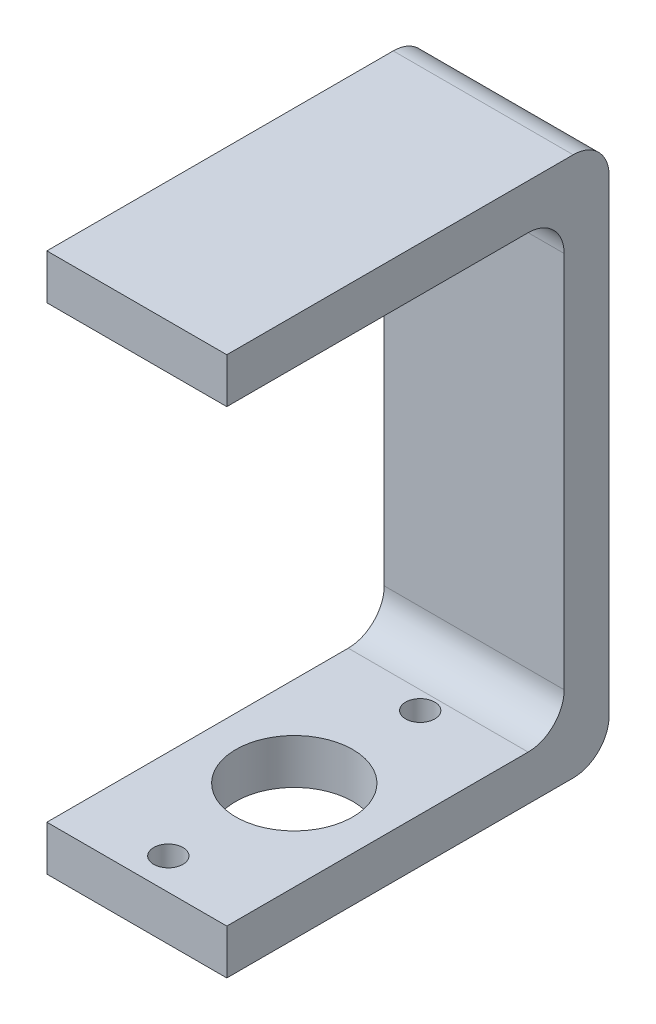
ISO-10303-21;
HEADER;
FILE_DESCRIPTION(('STEP AP214'),'2;1');
FILE_NAME('part.step','',(''),(''),'','','');
FILE_SCHEMA(('AUTOMOTIVE_DESIGN { 1 0 10303 214 1 1 1 1 }'));
ENDSEC;
DATA;
#1=APPLICATION_CONTEXT('core data for automotive mechanical design processes');
#2=APPLICATION_PROTOCOL_DEFINITION('international standard','automotive_design',2000,#1);
#3=PRODUCT_CONTEXT('',#1,'mechanical');
#4=PRODUCT('Part','Part','',(#3));
#5=PRODUCT_RELATED_PRODUCT_CATEGORY('part','',(#4));
#6=PRODUCT_DEFINITION_FORMATION('','',#4);
#7=PRODUCT_DEFINITION_CONTEXT('part definition',#1,'design');
#8=PRODUCT_DEFINITION('design','',#6,#7);
#9=PRODUCT_DEFINITION_SHAPE('','',#8);
#10=(LENGTH_UNIT() NAMED_UNIT(*) SI_UNIT(.MILLI.,.METRE.));
#11=(NAMED_UNIT(*) PLANE_ANGLE_UNIT() SI_UNIT($,.RADIAN.));
#12=(NAMED_UNIT(*) SI_UNIT($,.STERADIAN.) SOLID_ANGLE_UNIT());
#13=UNCERTAINTY_MEASURE_WITH_UNIT(LENGTH_MEASURE(1.E-05),#10,'distance_accuracy_value','');
#14=(GEOMETRIC_REPRESENTATION_CONTEXT(3) GLOBAL_UNCERTAINTY_ASSIGNED_CONTEXT((#13)) GLOBAL_UNIT_ASSIGNED_CONTEXT((#10,
#11,#12)) REPRESENTATION_CONTEXT('',''));
#15=CARTESIAN_POINT('',(0.,0.,0.));
#16=DIRECTION('',(0.,0.,1.));
#17=DIRECTION('',(1.,0.,0.));
#18=AXIS2_PLACEMENT_3D('',#15,#16,#17);
#19=CARTESIAN_POINT('',(40.,10.,0.));
#20=DIRECTION('',(0.,0.,-1.));
#21=DIRECTION('',(0.,1.,0.));
#22=AXIS2_PLACEMENT_3D('',#19,#20,#21);
#23=PLANE('',#22);
#24=DIRECTION('',(0.,-1.,0.));
#25=VECTOR('',#24,1.);
#26=CARTESIAN_POINT('',(0.,10.,0.));
#27=LINE('',#26,#25);
#28=CARTESIAN_POINT('',(0.,10.,0.));
#29=VERTEX_POINT('',#28);
#30=CARTESIAN_POINT('',(0.,0.,0.));
#31=VERTEX_POINT('',#30);
#32=EDGE_CURVE('E157',#29,#31,#27,.T.);
#33=ORIENTED_EDGE('',*,*,#32,.T.);
#34=DIRECTION('',(-1.,0.,0.));
#35=VECTOR('',#34,1.);
#36=CARTESIAN_POINT('',(40.,0.,0.));
#37=LINE('',#36,#35);
#38=CARTESIAN_POINT('',(40.,0.,0.));
#39=VERTEX_POINT('',#38);
#40=EDGE_CURVE('E11',#39,#31,#37,.T.);
#41=ORIENTED_EDGE('',*,*,#40,.F.);
#42=DIRECTION('',(0.,-1.,0.));
#43=VECTOR('',#42,1.);
#44=CARTESIAN_POINT('',(40.,10.,0.));
#45=LINE('',#44,#43);
#46=CARTESIAN_POINT('',(40.,10.,0.));
#47=VERTEX_POINT('',#46);
#48=EDGE_CURVE('E180',#47,#39,#45,.T.);
#49=ORIENTED_EDGE('',*,*,#48,.F.);
#50=DIRECTION('',(-1.,0.,0.));
#51=VECTOR('',#50,1.);
#52=CARTESIAN_POINT('',(40.,10.,0.));
#53=LINE('',#52,#51);
#54=EDGE_CURVE('E153',#47,#29,#53,.T.);
#55=ORIENTED_EDGE('',*,*,#54,.T.);
#56=EDGE_LOOP('',(#33,#41,#49,#55));
#57=FACE_BOUND('',#56,.T.);
#58=ADVANCED_FACE('F35',(#57),#23,.F.);
#59=CARTESIAN_POINT('',(40.,0.,0.));
#60=DIRECTION('',(0.,1.,0.));
#61=DIRECTION('',(0.,0.,1.));
#62=AXIS2_PLACEMENT_3D('',#59,#60,#61);
#63=PLANE('',#62);
#64=CARTESIAN_POINT('',(20.,0.,-63.));
#65=DIRECTION('',(0.,-1.,0.));
#66=DIRECTION('',(0.,0.,-1.));
#67=AXIS2_PLACEMENT_3D('',#64,#65,#66);
#68=CIRCLE('',#67,3.25);
#69=CARTESIAN_POINT('',(20.,0.,-66.25));
#70=VERTEX_POINT('',#69);
#71=EDGE_CURVE('E216',#70,#70,#68,.T.);
#72=ORIENTED_EDGE('',*,*,#71,.F.);
#73=EDGE_LOOP('',(#72));
#74=FACE_BOUND('',#73,.T.);
#75=CARTESIAN_POINT('',(20.,0.,-7.00000000000001));
#76=DIRECTION('',(0.,-1.,0.));
#77=DIRECTION('',(0.,0.,-1.));
#78=AXIS2_PLACEMENT_3D('',#75,#76,#77);
#79=CIRCLE('',#78,3.25);
#80=CARTESIAN_POINT('',(20.,0.,-10.25));
#81=VERTEX_POINT('',#80);
#82=EDGE_CURVE('E206',#81,#81,#79,.T.);
#83=ORIENTED_EDGE('',*,*,#82,.F.);
#84=EDGE_LOOP('',(#83));
#85=FACE_BOUND('',#84,.T.);
#86=CARTESIAN_POINT('',(20.,0.,-35.));
#87=DIRECTION('',(0.,-1.,0.));
#88=DIRECTION('',(0.,0.,-1.));
#89=AXIS2_PLACEMENT_3D('',#86,#87,#88);
#90=CIRCLE('',#89,13.);
#91=CARTESIAN_POINT('',(20.,0.,-48.));
#92=VERTEX_POINT('',#91);
#93=EDGE_CURVE('E161',#92,#92,#90,.T.);
#94=ORIENTED_EDGE('',*,*,#93,.F.);
#95=EDGE_LOOP('',(#94));
#96=FACE_BOUND('',#95,.T.);
#97=DIRECTION('',(0.,0.,-1.));
#98=VECTOR('',#97,1.);
#99=CARTESIAN_POINT('',(0.,0.,0.));
#100=LINE('',#99,#98);
#101=CARTESIAN_POINT('',(0.,0.,-77.));
#102=VERTEX_POINT('',#101);
#103=EDGE_CURVE('E160',#31,#102,#100,.T.);
#104=ORIENTED_EDGE('',*,*,#103,.T.);
#105=DIRECTION('',(-1.,0.,0.));
#106=VECTOR('',#105,1.);
#107=CARTESIAN_POINT('',(40.,0.,-77.));
#108=LINE('',#107,#106);
#109=CARTESIAN_POINT('',(40.,0.,-77.));
#110=VERTEX_POINT('',#109);
#111=EDGE_CURVE('E44',#110,#102,#108,.T.);
#112=ORIENTED_EDGE('',*,*,#111,.F.);
#113=DIRECTION('',(0.,0.,-1.));
#114=VECTOR('',#113,1.);
#115=CARTESIAN_POINT('',(40.,0.,0.));
#116=LINE('',#115,#114);
#117=EDGE_CURVE('E108',#39,#110,#116,.T.);
#118=ORIENTED_EDGE('',*,*,#117,.F.);
#119=ORIENTED_EDGE('',*,*,#40,.T.);
#120=EDGE_LOOP('',(#104,#112,#118,#119));
#121=FACE_BOUND('',#120,.T.);
#122=ADVANCED_FACE('F263',(#74,#85,#96,#121),#63,.F.);
#123=CARTESIAN_POINT('',(40.,8.,-77.));
#124=DIRECTION('',(-1.,0.,0.));
#125=DIRECTION('',(0.,0.,1.));
#126=AXIS2_PLACEMENT_3D('',#123,#124,#125);
#127=CYLINDRICAL_SURFACE('',#126,8.);
#128=CARTESIAN_POINT('',(0.,8.,-77.));
#129=DIRECTION('',(1.,0.,0.));
#130=DIRECTION('',(0.,0.,1.));
#131=AXIS2_PLACEMENT_3D('',#128,#129,#130);
#132=CIRCLE('',#131,8.);
#133=CARTESIAN_POINT('',(0.,8.,-85.));
#134=VERTEX_POINT('',#133);
#135=EDGE_CURVE('E163',#102,#134,#132,.T.);
#136=ORIENTED_EDGE('',*,*,#135,.T.);
#137=DIRECTION('',(-1.,0.,0.));
#138=VECTOR('',#137,1.);
#139=CARTESIAN_POINT('',(40.,8.,-85.));
#140=LINE('',#139,#138);
#141=CARTESIAN_POINT('',(40.,8.,-85.));
#142=VERTEX_POINT('',#141);
#143=EDGE_CURVE('E199',#142,#134,#140,.T.);
#144=ORIENTED_EDGE('',*,*,#143,.F.);
#145=CARTESIAN_POINT('',(40.,8.,-77.));
#146=DIRECTION('',(1.,0.,0.));
#147=DIRECTION('',(0.,0.,1.));
#148=AXIS2_PLACEMENT_3D('',#145,#146,#147);
#149=CIRCLE('',#148,8.);
#150=EDGE_CURVE('E223',#110,#142,#149,.T.);
#151=ORIENTED_EDGE('',*,*,#150,.F.);
#152=ORIENTED_EDGE('',*,*,#111,.T.);
#153=EDGE_LOOP('',(#136,#144,#151,#152));
#154=FACE_BOUND('',#153,.T.);
#155=ADVANCED_FACE('F267',(#154),#127,.T.);
#156=CARTESIAN_POINT('',(40.,8.,-85.));
#157=DIRECTION('',(0.,0.,1.));
#158=DIRECTION('',(1.,0.,0.));
#159=AXIS2_PLACEMENT_3D('',#156,#157,#158);
#160=PLANE('',#159);
#161=DIRECTION('',(0.,1.,0.));
#162=VECTOR('',#161,1.);
#163=CARTESIAN_POINT('',(0.,8.,-85.));
#164=LINE('',#163,#162);
#165=CARTESIAN_POINT('',(0.,112.,-85.));
#166=VERTEX_POINT('',#165);
#167=EDGE_CURVE('E165',#134,#166,#164,.T.);
#168=ORIENTED_EDGE('',*,*,#167,.T.);
#169=DIRECTION('',(-1.,0.,0.));
#170=VECTOR('',#169,1.);
#171=CARTESIAN_POINT('',(40.,112.,-85.));
#172=LINE('',#171,#170);
#173=CARTESIAN_POINT('',(40.,112.,-85.));
#174=VERTEX_POINT('',#173);
#175=EDGE_CURVE('E196',#174,#166,#172,.T.);
#176=ORIENTED_EDGE('',*,*,#175,.F.);
#177=DIRECTION('',(0.,1.,0.));
#178=VECTOR('',#177,1.);
#179=CARTESIAN_POINT('',(40.,8.,-85.));
#180=LINE('',#179,#178);
#181=EDGE_CURVE('E225',#142,#174,#180,.T.);
#182=ORIENTED_EDGE('',*,*,#181,.F.);
#183=ORIENTED_EDGE('',*,*,#143,.T.);
#184=EDGE_LOOP('',(#168,#176,#182,#183));
#185=FACE_BOUND('',#184,.T.);
#186=ADVANCED_FACE('F272',(#185),#160,.F.);
#187=CARTESIAN_POINT('',(40.,112.,-77.));
#188=DIRECTION('',(-1.,0.,0.));
#189=DIRECTION('',(0.,0.,1.));
#190=AXIS2_PLACEMENT_3D('',#187,#188,#189);
#191=CYLINDRICAL_SURFACE('',#190,8.);
#192=CARTESIAN_POINT('',(0.,112.,-77.));
#193=DIRECTION('',(1.,0.,0.));
#194=DIRECTION('',(0.,0.,-1.));
#195=AXIS2_PLACEMENT_3D('',#192,#193,#194);
#196=CIRCLE('',#195,8.);
#197=CARTESIAN_POINT('',(0.,120.,-77.));
#198=VERTEX_POINT('',#197);
#199=EDGE_CURVE('E167',#166,#198,#196,.T.);
#200=ORIENTED_EDGE('',*,*,#199,.T.);
#201=DIRECTION('',(-1.,0.,0.));
#202=VECTOR('',#201,1.);
#203=CARTESIAN_POINT('',(40.,120.,-77.));
#204=LINE('',#203,#202);
#205=CARTESIAN_POINT('',(40.,120.,-77.));
#206=VERTEX_POINT('',#205);
#207=EDGE_CURVE('E193',#206,#198,#204,.T.);
#208=ORIENTED_EDGE('',*,*,#207,.F.);
#209=CARTESIAN_POINT('',(40.,112.,-77.));
#210=DIRECTION('',(1.,0.,0.));
#211=DIRECTION('',(0.,0.,-1.));
#212=AXIS2_PLACEMENT_3D('',#209,#210,#211);
#213=CIRCLE('',#212,8.);
#214=EDGE_CURVE('E227',#174,#206,#213,.T.);
#215=ORIENTED_EDGE('',*,*,#214,.F.);
#216=ORIENTED_EDGE('',*,*,#175,.T.);
#217=EDGE_LOOP('',(#200,#208,#215,#216));
#218=FACE_BOUND('',#217,.T.);
#219=ADVANCED_FACE('F280',(#218),#191,.T.);
#220=CARTESIAN_POINT('',(40.,120.,-77.));
#221=DIRECTION('',(0.,-1.,0.));
#222=DIRECTION('',(0.,0.,-1.));
#223=AXIS2_PLACEMENT_3D('',#220,#221,#222);
#224=PLANE('',#223);
#225=DIRECTION('',(0.,0.,1.));
#226=VECTOR('',#225,1.);
#227=CARTESIAN_POINT('',(0.,120.,-77.));
#228=LINE('',#227,#226);
#229=CARTESIAN_POINT('',(0.,120.,0.));
#230=VERTEX_POINT('',#229);
#231=EDGE_CURVE('E169',#198,#230,#228,.T.);
#232=ORIENTED_EDGE('',*,*,#231,.T.);
#233=DIRECTION('',(-1.,0.,0.));
#234=VECTOR('',#233,1.);
#235=CARTESIAN_POINT('',(40.,120.,0.));
#236=LINE('',#235,#234);
#237=CARTESIAN_POINT('',(40.,120.,0.));
#238=VERTEX_POINT('',#237);
#239=EDGE_CURVE('E190',#238,#230,#236,.T.);
#240=ORIENTED_EDGE('',*,*,#239,.F.);
#241=DIRECTION('',(0.,0.,1.));
#242=VECTOR('',#241,1.);
#243=CARTESIAN_POINT('',(40.,120.,-77.));
#244=LINE('',#243,#242);
#245=EDGE_CURVE('E229',#206,#238,#244,.T.);
#246=ORIENTED_EDGE('',*,*,#245,.F.);
#247=ORIENTED_EDGE('',*,*,#207,.T.);
#248=EDGE_LOOP('',(#232,#240,#246,#247));
#249=FACE_BOUND('',#248,.T.);
#250=ADVANCED_FACE('F284',(#249),#224,.F.);
#251=CARTESIAN_POINT('',(40.,120.,0.));
#252=DIRECTION('',(0.,0.,-1.));
#253=DIRECTION('',(0.,1.,0.));
#254=AXIS2_PLACEMENT_3D('',#251,#252,#253);
#255=PLANE('',#254);
#256=DIRECTION('',(0.,-1.,0.));
#257=VECTOR('',#256,1.);
#258=CARTESIAN_POINT('',(0.,120.,0.));
#259=LINE('',#258,#257);
#260=CARTESIAN_POINT('',(0.,110.,0.));
#261=VERTEX_POINT('',#260);
#262=EDGE_CURVE('E171',#230,#261,#259,.T.);
#263=ORIENTED_EDGE('',*,*,#262,.T.);
#264=DIRECTION('',(-1.,0.,0.));
#265=VECTOR('',#264,1.);
#266=CARTESIAN_POINT('',(40.,110.,0.));
#267=LINE('',#266,#265);
#268=CARTESIAN_POINT('',(40.,110.,0.));
#269=VERTEX_POINT('',#268);
#270=EDGE_CURVE('E187',#269,#261,#267,.T.);
#271=ORIENTED_EDGE('',*,*,#270,.F.);
#272=DIRECTION('',(0.,-1.,0.));
#273=VECTOR('',#272,1.);
#274=CARTESIAN_POINT('',(40.,120.,0.));
#275=LINE('',#274,#273);
#276=EDGE_CURVE('E231',#238,#269,#275,.T.);
#277=ORIENTED_EDGE('',*,*,#276,.F.);
#278=ORIENTED_EDGE('',*,*,#239,.T.);
#279=EDGE_LOOP('',(#263,#271,#277,#278));
#280=FACE_BOUND('',#279,.T.);
#281=ADVANCED_FACE('F288',(#280),#255,.F.);
#282=CARTESIAN_POINT('',(40.,110.,0.));
#283=DIRECTION('',(0.,1.,0.));
#284=DIRECTION('',(0.,0.,1.));
#285=AXIS2_PLACEMENT_3D('',#282,#283,#284);
#286=PLANE('',#285);
#287=DIRECTION('',(0.,0.,-1.));
#288=VECTOR('',#287,1.);
#289=CARTESIAN_POINT('',(0.,110.,0.));
#290=LINE('',#289,#288);
#291=CARTESIAN_POINT('',(0.,110.,-67.));
#292=VERTEX_POINT('',#291);
#293=EDGE_CURVE('E173',#261,#292,#290,.T.);
#294=ORIENTED_EDGE('',*,*,#293,.T.);
#295=DIRECTION('',(-1.,0.,0.));
#296=VECTOR('',#295,1.);
#297=CARTESIAN_POINT('',(40.,110.,-67.));
#298=LINE('',#297,#296);
#299=CARTESIAN_POINT('',(40.,110.,-67.));
#300=VERTEX_POINT('',#299);
#301=EDGE_CURVE('E184',#300,#292,#298,.T.);
#302=ORIENTED_EDGE('',*,*,#301,.F.);
#303=DIRECTION('',(0.,0.,-1.));
#304=VECTOR('',#303,1.);
#305=CARTESIAN_POINT('',(40.,110.,0.));
#306=LINE('',#305,#304);
#307=EDGE_CURVE('E233',#269,#300,#306,.T.);
#308=ORIENTED_EDGE('',*,*,#307,.F.);
#309=ORIENTED_EDGE('',*,*,#270,.T.);
#310=EDGE_LOOP('',(#294,#302,#308,#309));
#311=FACE_BOUND('',#310,.T.);
#312=ADVANCED_FACE('F239',(#311),#286,.F.);
#313=CARTESIAN_POINT('',(40.,102.,-67.));
#314=DIRECTION('',(-1.,0.,0.));
#315=DIRECTION('',(0.,0.,1.));
#316=AXIS2_PLACEMENT_3D('',#313,#314,#315);
#317=CYLINDRICAL_SURFACE('',#316,8.00000000000001);
#318=CARTESIAN_POINT('',(0.,102.,-67.));
#319=DIRECTION('',(-1.,0.,0.));
#320=DIRECTION('',(0.,0.,-1.));
#321=AXIS2_PLACEMENT_3D('',#318,#319,#320);
#322=CIRCLE('',#321,8.00000000000001);
#323=CARTESIAN_POINT('',(0.,102.,-75.));
#324=VERTEX_POINT('',#323);
#325=EDGE_CURVE('E175',#292,#324,#322,.T.);
#326=ORIENTED_EDGE('',*,*,#325,.T.);
#327=DIRECTION('',(-1.,0.,0.));
#328=VECTOR('',#327,1.);
#329=CARTESIAN_POINT('',(40.,102.,-75.));
#330=LINE('',#329,#328);
#331=CARTESIAN_POINT('',(40.,102.,-75.));
#332=VERTEX_POINT('',#331);
#333=EDGE_CURVE('E148',#332,#324,#330,.T.);
#334=ORIENTED_EDGE('',*,*,#333,.F.);
#335=CARTESIAN_POINT('',(40.,102.,-67.));
#336=DIRECTION('',(-1.,0.,0.));
#337=DIRECTION('',(0.,0.,-1.));
#338=AXIS2_PLACEMENT_3D('',#335,#336,#337);
#339=CIRCLE('',#338,8.00000000000001);
#340=EDGE_CURVE('E139',#300,#332,#339,.T.);
#341=ORIENTED_EDGE('',*,*,#340,.F.);
#342=ORIENTED_EDGE('',*,*,#301,.T.);
#343=EDGE_LOOP('',(#326,#334,#341,#342));
#344=FACE_BOUND('',#343,.T.);
#345=ADVANCED_FACE('F243',(#344),#317,.F.);
#346=CARTESIAN_POINT('',(40.,102.,-75.));
#347=DIRECTION('',(0.,0.,-1.));
#348=DIRECTION('',(0.,1.,0.));
#349=AXIS2_PLACEMENT_3D('',#346,#347,#348);
#350=PLANE('',#349);
#351=DIRECTION('',(0.,-1.,0.));
#352=VECTOR('',#351,1.);
#353=CARTESIAN_POINT('',(0.,102.,-75.));
#354=LINE('',#353,#352);
#355=CARTESIAN_POINT('',(0.,18.,-75.));
#356=VERTEX_POINT('',#355);
#357=EDGE_CURVE('E147',#324,#356,#354,.T.);
#358=ORIENTED_EDGE('',*,*,#357,.T.);
#359=DIRECTION('',(-1.,0.,0.));
#360=VECTOR('',#359,1.);
#361=CARTESIAN_POINT('',(40.,18.,-75.));
#362=LINE('',#361,#360);
#363=CARTESIAN_POINT('',(40.,18.,-75.));
#364=VERTEX_POINT('',#363);
#365=EDGE_CURVE('E144',#364,#356,#362,.T.);
#366=ORIENTED_EDGE('',*,*,#365,.F.);
#367=DIRECTION('',(0.,-1.,0.));
#368=VECTOR('',#367,1.);
#369=CARTESIAN_POINT('',(40.,102.,-75.));
#370=LINE('',#369,#368);
#371=EDGE_CURVE('E133',#332,#364,#370,.T.);
#372=ORIENTED_EDGE('',*,*,#371,.F.);
#373=ORIENTED_EDGE('',*,*,#333,.T.);
#374=EDGE_LOOP('',(#358,#366,#372,#373));
#375=FACE_BOUND('',#374,.T.);
#376=ADVANCED_FACE('F145',(#375),#350,.F.);
#377=CARTESIAN_POINT('',(40.,18.,-67.));
#378=DIRECTION('',(-1.,0.,0.));
#379=DIRECTION('',(0.,0.,1.));
#380=AXIS2_PLACEMENT_3D('',#377,#378,#379);
#381=CYLINDRICAL_SURFACE('',#380,8.);
#382=CARTESIAN_POINT('',(0.,18.,-67.));
#383=DIRECTION('',(-1.,0.,0.));
#384=DIRECTION('',(0.,0.,-1.));
#385=AXIS2_PLACEMENT_3D('',#382,#383,#384);
#386=CIRCLE('',#385,8.);
#387=CARTESIAN_POINT('',(0.,10.,-67.));
#388=VERTEX_POINT('',#387);
#389=EDGE_CURVE('E94',#356,#388,#386,.T.);
#390=ORIENTED_EDGE('',*,*,#389,.T.);
#391=DIRECTION('',(-1.,0.,0.));
#392=VECTOR('',#391,1.);
#393=CARTESIAN_POINT('',(40.,10.,-67.));
#394=LINE('',#393,#392);
#395=CARTESIAN_POINT('',(40.,10.,-67.));
#396=VERTEX_POINT('',#395);
#397=EDGE_CURVE('E149',#396,#388,#394,.T.);
#398=ORIENTED_EDGE('',*,*,#397,.F.);
#399=CARTESIAN_POINT('',(40.,18.,-67.));
#400=DIRECTION('',(-1.,0.,0.));
#401=DIRECTION('',(0.,0.,-1.));
#402=AXIS2_PLACEMENT_3D('',#399,#400,#401);
#403=CIRCLE('',#402,8.);
#404=EDGE_CURVE('E137',#364,#396,#403,.T.);
#405=ORIENTED_EDGE('',*,*,#404,.F.);
#406=ORIENTED_EDGE('',*,*,#365,.T.);
#407=EDGE_LOOP('',(#390,#398,#405,#406));
#408=FACE_BOUND('',#407,.T.);
#409=ADVANCED_FACE('F151',(#408),#381,.F.);
#410=CARTESIAN_POINT('',(40.,10.,-67.));
#411=DIRECTION('',(0.,-1.,0.));
#412=DIRECTION('',(0.,0.,-1.));
#413=AXIS2_PLACEMENT_3D('',#410,#411,#412);
#414=PLANE('',#413);
#415=CARTESIAN_POINT('',(20.,10.,-63.));
#416=DIRECTION('',(0.,-1.,0.));
#417=DIRECTION('',(0.,0.,-1.));
#418=AXIS2_PLACEMENT_3D('',#415,#416,#417);
#419=CIRCLE('',#418,3.25);
#420=CARTESIAN_POINT('',(20.,10.,-66.25));
#421=VERTEX_POINT('',#420);
#422=EDGE_CURVE('E38',#421,#421,#419,.T.);
#423=ORIENTED_EDGE('',*,*,#422,.T.);
#424=EDGE_LOOP('',(#423));
#425=FACE_BOUND('',#424,.T.);
#426=CARTESIAN_POINT('',(20.,10.,-7.00000000000001));
#427=DIRECTION('',(0.,-1.,0.));
#428=DIRECTION('',(0.,0.,-1.));
#429=AXIS2_PLACEMENT_3D('',#426,#427,#428);
#430=CIRCLE('',#429,3.25);
#431=CARTESIAN_POINT('',(20.,10.,-10.25));
#432=VERTEX_POINT('',#431);
#433=EDGE_CURVE('E203',#432,#432,#430,.T.);
#434=ORIENTED_EDGE('',*,*,#433,.T.);
#435=EDGE_LOOP('',(#434));
#436=FACE_BOUND('',#435,.T.);
#437=CARTESIAN_POINT('',(20.,10.,-35.));
#438=DIRECTION('',(0.,-1.,0.));
#439=DIRECTION('',(0.,0.,-1.));
#440=AXIS2_PLACEMENT_3D('',#437,#438,#439);
#441=CIRCLE('',#440,13.);
#442=CARTESIAN_POINT('',(20.,10.,-48.));
#443=VERTEX_POINT('',#442);
#444=EDGE_CURVE('E205',#443,#443,#441,.F.);
#445=ORIENTED_EDGE('',*,*,#444,.F.);
#446=EDGE_LOOP('',(#445));
#447=FACE_BOUND('',#446,.T.);
#448=DIRECTION('',(0.,0.,1.));
#449=VECTOR('',#448,1.);
#450=CARTESIAN_POINT('',(0.,10.,-67.));
#451=LINE('',#450,#449);
#452=EDGE_CURVE('E100',#388,#29,#451,.T.);
#453=ORIENTED_EDGE('',*,*,#452,.T.);
#454=ORIENTED_EDGE('',*,*,#54,.F.);
#455=DIRECTION('',(0.,0.,1.));
#456=VECTOR('',#455,1.);
#457=CARTESIAN_POINT('',(40.,10.,-67.));
#458=LINE('',#457,#456);
#459=EDGE_CURVE('E53',#396,#47,#458,.T.);
#460=ORIENTED_EDGE('',*,*,#459,.F.);
#461=ORIENTED_EDGE('',*,*,#397,.T.);
#462=EDGE_LOOP('',(#453,#454,#460,#461));
#463=FACE_BOUND('',#462,.T.);
#464=ADVANCED_FACE('F251',(#425,#436,#447,#463),#414,.F.);
#465=CARTESIAN_POINT('',(40.,8.,-77.));
#466=DIRECTION('',(-1.,0.,0.));
#467=DIRECTION('',(0.,0.,1.));
#468=AXIS2_PLACEMENT_3D('',#465,#466,#467);
#469=PLANE('',#468);
#470=ORIENTED_EDGE('',*,*,#48,.T.);
#471=ORIENTED_EDGE('',*,*,#117,.T.);
#472=ORIENTED_EDGE('',*,*,#150,.T.);
#473=ORIENTED_EDGE('',*,*,#181,.T.);
#474=ORIENTED_EDGE('',*,*,#214,.T.);
#475=ORIENTED_EDGE('',*,*,#245,.T.);
#476=ORIENTED_EDGE('',*,*,#276,.T.);
#477=ORIENTED_EDGE('',*,*,#307,.T.);
#478=ORIENTED_EDGE('',*,*,#340,.T.);
#479=ORIENTED_EDGE('',*,*,#371,.T.);
#480=ORIENTED_EDGE('',*,*,#404,.T.);
#481=ORIENTED_EDGE('',*,*,#459,.T.);
#482=EDGE_LOOP('',(#470,#471,#472,#473,#474,#475,#476,#477,#478,#479,#480,#481));
#483=FACE_BOUND('',#482,.T.);
#484=ADVANCED_FACE('F135',(#483),#469,.F.);
#485=CARTESIAN_POINT('',(0.,8.,-77.));
#486=DIRECTION('',(-1.,0.,0.));
#487=DIRECTION('',(0.,0.,1.));
#488=AXIS2_PLACEMENT_3D('',#485,#486,#487);
#489=PLANE('',#488);
#490=ORIENTED_EDGE('',*,*,#32,.F.);
#491=ORIENTED_EDGE('',*,*,#452,.F.);
#492=ORIENTED_EDGE('',*,*,#389,.F.);
#493=ORIENTED_EDGE('',*,*,#357,.F.);
#494=ORIENTED_EDGE('',*,*,#325,.F.);
#495=ORIENTED_EDGE('',*,*,#293,.F.);
#496=ORIENTED_EDGE('',*,*,#262,.F.);
#497=ORIENTED_EDGE('',*,*,#231,.F.);
#498=ORIENTED_EDGE('',*,*,#199,.F.);
#499=ORIENTED_EDGE('',*,*,#167,.F.);
#500=ORIENTED_EDGE('',*,*,#135,.F.);
#501=ORIENTED_EDGE('',*,*,#103,.F.);
#502=EDGE_LOOP('',(#490,#491,#492,#493,#494,#495,#496,#497,#498,#499,#500,#501));
#503=FACE_BOUND('',#502,.T.);
#504=ADVANCED_FACE('F246',(#503),#489,.T.);
#505=CARTESIAN_POINT('',(20.,120.001,-35.));
#506=DIRECTION('',(0.,-1.,0.));
#507=DIRECTION('',(0.,0.,-1.));
#508=AXIS2_PLACEMENT_3D('',#505,#506,#507);
#509=CYLINDRICAL_SURFACE('',#508,13.);
#510=ORIENTED_EDGE('',*,*,#93,.T.);
#511=EDGE_LOOP('',(#510));
#512=FACE_BOUND('',#511,.T.);
#513=ORIENTED_EDGE('',*,*,#444,.T.);
#514=EDGE_LOOP('',(#513));
#515=FACE_BOUND('',#514,.T.);
#516=ADVANCED_FACE('F322',(#512,#515),#509,.F.);
#517=CARTESIAN_POINT('',(20.,20.,-7.00000000000001));
#518=DIRECTION('',(0.,-1.,0.));
#519=DIRECTION('',(0.,0.,-1.));
#520=AXIS2_PLACEMENT_3D('',#517,#518,#519);
#521=CYLINDRICAL_SURFACE('',#520,3.25);
#522=ORIENTED_EDGE('',*,*,#82,.T.);
#523=EDGE_LOOP('',(#522));
#524=FACE_BOUND('',#523,.T.);
#525=ORIENTED_EDGE('',*,*,#433,.F.);
#526=EDGE_LOOP('',(#525));
#527=FACE_BOUND('',#526,.T.);
#528=ADVANCED_FACE('F329',(#524,#527),#521,.F.);
#529=CARTESIAN_POINT('',(20.,20.,-63.));
#530=DIRECTION('',(0.,-1.,0.));
#531=DIRECTION('',(0.,0.,-1.));
#532=AXIS2_PLACEMENT_3D('',#529,#530,#531);
#533=CYLINDRICAL_SURFACE('',#532,3.25);
#534=ORIENTED_EDGE('',*,*,#71,.T.);
#535=EDGE_LOOP('',(#534));
#536=FACE_BOUND('',#535,.T.);
#537=ORIENTED_EDGE('',*,*,#422,.F.);
#538=EDGE_LOOP('',(#537));
#539=FACE_BOUND('',#538,.T.);
#540=ADVANCED_FACE('F349',(#536,#539),#533,.F.);
#541=CLOSED_SHELL('',(#58,#122,#155,#186,#219,#250,#281,#312,#345,#376,#409,#464,#484,#504,#516,
#528,#540));
#542=MANIFOLD_SOLID_BREP('B2',#541);
#543=ADVANCED_BREP_SHAPE_REPRESENTATION('',(#18,#542),#14);
#544=SHAPE_DEFINITION_REPRESENTATION(#9,#543);
ENDSEC;
END-ISO-10303-21;
